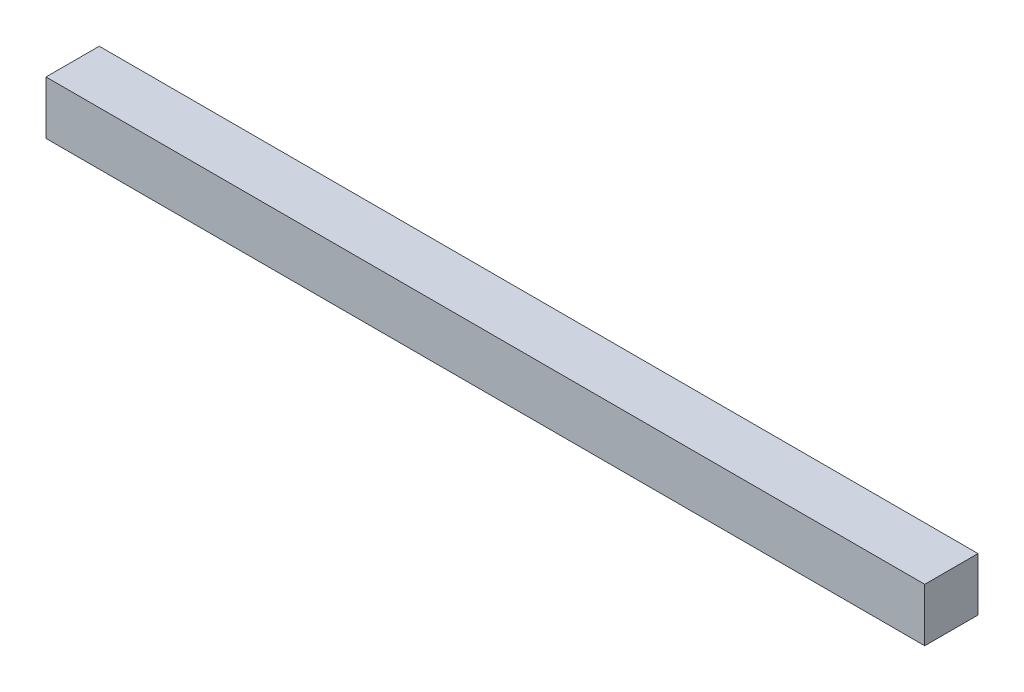
ISO-10303-21;
HEADER;
FILE_DESCRIPTION(('STEP AP214'),'2;1');
FILE_NAME('part.step','',(''),(''),'','','');
FILE_SCHEMA(('AUTOMOTIVE_DESIGN { 1 0 10303 214 1 1 1 1 }'));
ENDSEC;
DATA;
#1=APPLICATION_CONTEXT('core data for automotive mechanical design processes');
#2=APPLICATION_PROTOCOL_DEFINITION('international standard','automotive_design',2000,#1);
#3=PRODUCT_CONTEXT('',#1,'mechanical');
#4=PRODUCT('Part','Part','',(#3));
#5=PRODUCT_RELATED_PRODUCT_CATEGORY('part','',(#4));
#6=PRODUCT_DEFINITION_FORMATION('','',#4);
#7=PRODUCT_DEFINITION_CONTEXT('part definition',#1,'design');
#8=PRODUCT_DEFINITION('design','',#6,#7);
#9=PRODUCT_DEFINITION_SHAPE('','',#8);
#10=(LENGTH_UNIT() NAMED_UNIT(*) SI_UNIT(.MILLI.,.METRE.));
#11=(NAMED_UNIT(*) PLANE_ANGLE_UNIT() SI_UNIT($,.RADIAN.));
#12=(NAMED_UNIT(*) SI_UNIT($,.STERADIAN.) SOLID_ANGLE_UNIT());
#13=UNCERTAINTY_MEASURE_WITH_UNIT(LENGTH_MEASURE(1.E-05),#10,'distance_accuracy_value','');
#14=(GEOMETRIC_REPRESENTATION_CONTEXT(3) GLOBAL_UNCERTAINTY_ASSIGNED_CONTEXT((#13)) GLOBAL_UNIT_ASSIGNED_CONTEXT((#10,
#11,#12)) REPRESENTATION_CONTEXT('',''));
#15=CARTESIAN_POINT('',(0.,0.,0.));
#16=DIRECTION('',(0.,0.,1.));
#17=DIRECTION('',(1.,0.,0.));
#18=AXIS2_PLACEMENT_3D('',#15,#16,#17);
#19=CARTESIAN_POINT('',(330.,-20.0000000000001,0.));
#20=DIRECTION('',(0.,1.,0.));
#21=DIRECTION('',(0.,0.,1.));
#22=AXIS2_PLACEMENT_3D('',#19,#20,#21);
#23=PLANE('',#22);
#24=DIRECTION('',(1.,0.,0.));
#25=VECTOR('',#24,1.);
#26=CARTESIAN_POINT('',(330.,-20.,-20.));
#27=LINE('',#26,#25);
#28=CARTESIAN_POINT('',(0.,-20.,-20.));
#29=VERTEX_POINT('',#28);
#30=CARTESIAN_POINT('',(660.,-20.,-20.));
#31=VERTEX_POINT('',#30);
#32=EDGE_CURVE('E73',#29,#31,#27,.T.);
#33=ORIENTED_EDGE('',*,*,#32,.T.);
#34=DIRECTION('',(0.,0.,1.));
#35=VECTOR('',#34,1.);
#36=CARTESIAN_POINT('',(660.,-20.0000000000001,0.));
#37=LINE('',#36,#35);
#38=CARTESIAN_POINT('',(660.,-20.,20.));
#39=VERTEX_POINT('',#38);
#40=EDGE_CURVE('E55',#31,#39,#37,.T.);
#41=ORIENTED_EDGE('',*,*,#40,.T.);
#42=DIRECTION('',(1.,0.,0.));
#43=VECTOR('',#42,1.);
#44=CARTESIAN_POINT('',(330.,-20.,20.));
#45=LINE('',#44,#43);
#46=CARTESIAN_POINT('',(0.,-20.,20.));
#47=VERTEX_POINT('',#46);
#48=EDGE_CURVE('E17',#47,#39,#45,.T.);
#49=ORIENTED_EDGE('',*,*,#48,.F.);
#50=DIRECTION('',(0.,0.,1.));
#51=VECTOR('',#50,1.);
#52=CARTESIAN_POINT('',(0.,-20.,0.));
#53=LINE('',#52,#51);
#54=EDGE_CURVE('E52',#47,#29,#53,.F.);
#55=ORIENTED_EDGE('',*,*,#54,.T.);
#56=EDGE_LOOP('',(#33,#41,#49,#55));
#57=FACE_BOUND('',#56,.T.);
#58=ADVANCED_FACE('F14',(#57),#23,.F.);
#59=CARTESIAN_POINT('',(330.,0.,20.));
#60=DIRECTION('',(0.,0.,1.));
#61=DIRECTION('',(1.,0.,0.));
#62=AXIS2_PLACEMENT_3D('',#59,#60,#61);
#63=PLANE('',#62);
#64=DIRECTION('',(1.,0.,0.));
#65=VECTOR('',#64,1.);
#66=CARTESIAN_POINT('',(330.,19.9999999999999,20.));
#67=LINE('',#66,#65);
#68=CARTESIAN_POINT('',(660.,19.9999999999999,20.));
#69=VERTEX_POINT('',#68);
#70=CARTESIAN_POINT('',(0.,19.9999999999999,20.));
#71=VERTEX_POINT('',#70);
#72=EDGE_CURVE('E70',#69,#71,#67,.F.);
#73=ORIENTED_EDGE('',*,*,#72,.T.);
#74=DIRECTION('',(0.,1.,0.));
#75=VECTOR('',#74,1.);
#76=CARTESIAN_POINT('',(0.,0.,20.));
#77=LINE('',#76,#75);
#78=EDGE_CURVE('E60',#71,#47,#77,.F.);
#79=ORIENTED_EDGE('',*,*,#78,.T.);
#80=ORIENTED_EDGE('',*,*,#48,.T.);
#81=DIRECTION('',(0.,-1.,0.));
#82=VECTOR('',#81,1.);
#83=CARTESIAN_POINT('',(660.,-1.21236029028415E-13,20.));
#84=LINE('',#83,#82);
#85=EDGE_CURVE('E75',#39,#69,#84,.F.);
#86=ORIENTED_EDGE('',*,*,#85,.T.);
#87=EDGE_LOOP('',(#73,#79,#80,#86));
#88=FACE_BOUND('',#87,.T.);
#89=ADVANCED_FACE('F69',(#88),#63,.T.);
#90=CARTESIAN_POINT('',(0.,0.,0.));
#91=DIRECTION('',(1.,0.,0.));
#92=DIRECTION('',(0.,1.,0.));
#93=AXIS2_PLACEMENT_3D('',#90,#91,#92);
#94=PLANE('',#93);
#95=DIRECTION('',(0.,1.,0.));
#96=VECTOR('',#95,1.);
#97=CARTESIAN_POINT('',(0.,0.,-20.));
#98=LINE('',#97,#96);
#99=CARTESIAN_POINT('',(0.,20.,-20.));
#100=VERTEX_POINT('',#99);
#101=EDGE_CURVE('E66',#100,#29,#98,.F.);
#102=ORIENTED_EDGE('',*,*,#101,.T.);
#103=ORIENTED_EDGE('',*,*,#54,.F.);
#104=ORIENTED_EDGE('',*,*,#78,.F.);
#105=DIRECTION('',(0.,0.,1.));
#106=VECTOR('',#105,1.);
#107=CARTESIAN_POINT('',(0.,20.,0.));
#108=LINE('',#107,#106);
#109=EDGE_CURVE('E80',#71,#100,#108,.F.);
#110=ORIENTED_EDGE('',*,*,#109,.T.);
#111=EDGE_LOOP('',(#102,#103,#104,#110));
#112=FACE_BOUND('',#111,.T.);
#113=ADVANCED_FACE('F63',(#112),#94,.F.);
#114=CARTESIAN_POINT('',(330.,0.,-20.));
#115=DIRECTION('',(0.,0.,1.));
#116=DIRECTION('',(1.,0.,0.));
#117=AXIS2_PLACEMENT_3D('',#114,#115,#116);
#118=PLANE('',#117);
#119=ORIENTED_EDGE('',*,*,#101,.F.);
#120=DIRECTION('',(1.,0.,0.));
#121=VECTOR('',#120,1.);
#122=CARTESIAN_POINT('',(330.,19.9999999999999,-20.));
#123=LINE('',#122,#121);
#124=CARTESIAN_POINT('',(660.,19.9999999999999,-20.));
#125=VERTEX_POINT('',#124);
#126=EDGE_CURVE('E23',#100,#125,#123,.T.);
#127=ORIENTED_EDGE('',*,*,#126,.T.);
#128=DIRECTION('',(0.,-1.,0.));
#129=VECTOR('',#128,1.);
#130=CARTESIAN_POINT('',(660.,-1.21236029028415E-13,-20.));
#131=LINE('',#130,#129);
#132=EDGE_CURVE('E31',#125,#31,#131,.T.);
#133=ORIENTED_EDGE('',*,*,#132,.T.);
#134=ORIENTED_EDGE('',*,*,#32,.F.);
#135=EDGE_LOOP('',(#119,#127,#133,#134));
#136=FACE_BOUND('',#135,.T.);
#137=ADVANCED_FACE('F85',(#136),#118,.F.);
#138=CARTESIAN_POINT('',(660.,-1.21236029028415E-13,0.));
#139=DIRECTION('',(-1.,0.,0.));
#140=DIRECTION('',(0.,-1.,0.));
#141=AXIS2_PLACEMENT_3D('',#138,#139,#140);
#142=PLANE('',#141);
#143=ORIENTED_EDGE('',*,*,#132,.F.);
#144=DIRECTION('',(0.,0.,1.));
#145=VECTOR('',#144,1.);
#146=CARTESIAN_POINT('',(660.,19.9999999999999,0.));
#147=LINE('',#146,#145);
#148=EDGE_CURVE('E9',#125,#69,#147,.T.);
#149=ORIENTED_EDGE('',*,*,#148,.T.);
#150=ORIENTED_EDGE('',*,*,#85,.F.);
#151=ORIENTED_EDGE('',*,*,#40,.F.);
#152=EDGE_LOOP('',(#143,#149,#150,#151));
#153=FACE_BOUND('',#152,.T.);
#154=ADVANCED_FACE('F88',(#153),#142,.F.);
#155=CARTESIAN_POINT('',(330.,19.9999999999999,0.));
#156=DIRECTION('',(0.,-1.,0.));
#157=DIRECTION('',(1.,0.,0.));
#158=AXIS2_PLACEMENT_3D('',#155,#156,#157);
#159=PLANE('',#158);
#160=ORIENTED_EDGE('',*,*,#126,.F.);
#161=ORIENTED_EDGE('',*,*,#109,.F.);
#162=ORIENTED_EDGE('',*,*,#72,.F.);
#163=ORIENTED_EDGE('',*,*,#148,.F.);
#164=EDGE_LOOP('',(#160,#161,#162,#163));
#165=FACE_BOUND('',#164,.T.);
#166=ADVANCED_FACE('F87',(#165),#159,.F.);
#167=CLOSED_SHELL('',(#58,#89,#113,#137,#154,#166));
#168=MANIFOLD_SOLID_BREP('B1',#167);
#169=ADVANCED_BREP_SHAPE_REPRESENTATION('',(#18,#168),#14);
#170=SHAPE_DEFINITION_REPRESENTATION(#9,#169);
ENDSEC;
END-ISO-10303-21;
